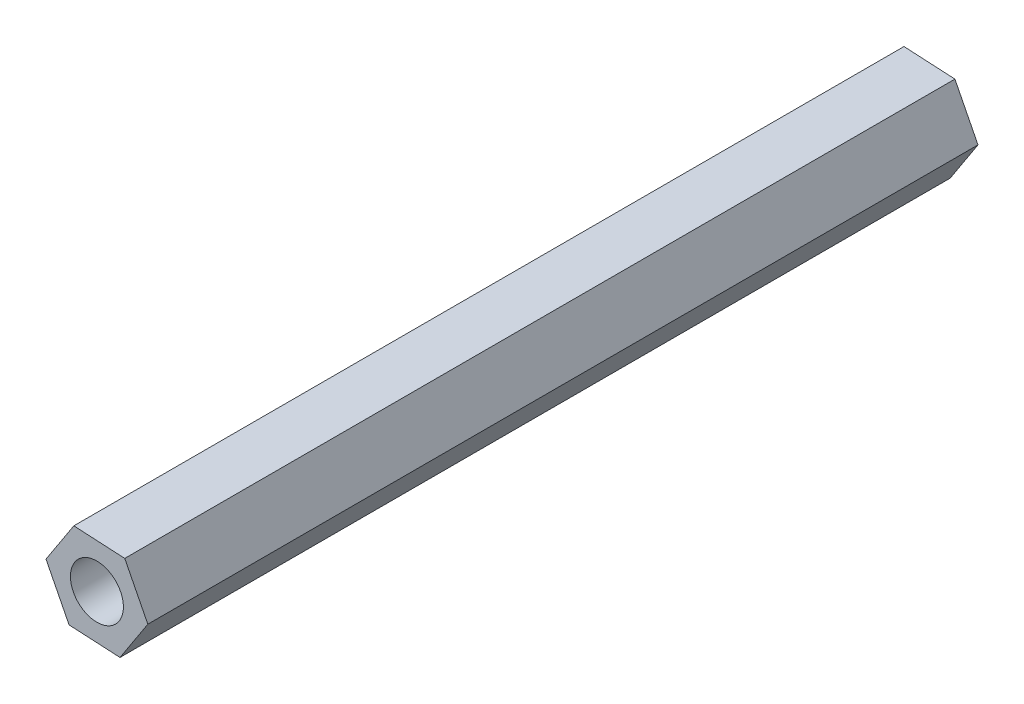
ISO-10303-21;
HEADER;
FILE_DESCRIPTION(('STEP AP214'),'2;1');
FILE_NAME('part.step','',(''),(''),'','','');
FILE_SCHEMA(('AUTOMOTIVE_DESIGN { 1 0 10303 214 1 1 1 1 }'));
ENDSEC;
DATA;
#1=APPLICATION_CONTEXT('core data for automotive mechanical design processes');
#2=APPLICATION_PROTOCOL_DEFINITION('international standard','automotive_design',2000,#1);
#3=PRODUCT_CONTEXT('',#1,'mechanical');
#4=PRODUCT('Part','Part','',(#3));
#5=PRODUCT_RELATED_PRODUCT_CATEGORY('part','',(#4));
#6=PRODUCT_DEFINITION_FORMATION('','',#4);
#7=PRODUCT_DEFINITION_CONTEXT('part definition',#1,'design');
#8=PRODUCT_DEFINITION('design','',#6,#7);
#9=PRODUCT_DEFINITION_SHAPE('','',#8);
#10=(LENGTH_UNIT() NAMED_UNIT(*) SI_UNIT(.MILLI.,.METRE.));
#11=(NAMED_UNIT(*) PLANE_ANGLE_UNIT() SI_UNIT($,.RADIAN.));
#12=(NAMED_UNIT(*) SI_UNIT($,.STERADIAN.) SOLID_ANGLE_UNIT());
#13=UNCERTAINTY_MEASURE_WITH_UNIT(LENGTH_MEASURE(1.E-05),#10,'distance_accuracy_value','');
#14=(GEOMETRIC_REPRESENTATION_CONTEXT(3) GLOBAL_UNCERTAINTY_ASSIGNED_CONTEXT((#13)) GLOBAL_UNIT_ASSIGNED_CONTEXT((#10,
#11,#12)) REPRESENTATION_CONTEXT('',''));
#15=CARTESIAN_POINT('',(0.,0.,0.));
#16=DIRECTION('',(0.,0.,1.));
#17=DIRECTION('',(1.,0.,0.));
#18=AXIS2_PLACEMENT_3D('',#15,#16,#17);
#19=CARTESIAN_POINT('',(2.8825916016709,-0.154916078280261,47.));
#20=DIRECTION('',(-0.891609732350342,-0.452804687672456,0.));
#21=DIRECTION('',(0.452804687672456,-0.891609732350343,0.));
#22=AXIS2_PLACEMENT_3D('',#19,#20,#21);
#23=PLANE('',#22);
#24=DIRECTION('',(-0.452804687672456,0.891609732350342,0.));
#25=VECTOR('',#24,1.);
#26=CARTESIAN_POINT('',(2.8825916016709,-0.154916078280261,0.));
#27=LINE('',#26,#25);
#28=CARTESIAN_POINT('',(2.8825916016709,-0.154916078280261,0.));
#29=VERTEX_POINT('',#28);
#30=CARTESIAN_POINT('',(1.57545706008081,2.41893951664254,0.));
#31=VERTEX_POINT('',#30);
#32=EDGE_CURVE('E115',#29,#31,#27,.T.);
#33=ORIENTED_EDGE('',*,*,#32,.T.);
#34=DIRECTION('',(0.,0.,-1.));
#35=VECTOR('',#34,1.);
#36=CARTESIAN_POINT('',(1.57545706008081,2.41893951664254,47.));
#37=LINE('',#36,#35);
#38=CARTESIAN_POINT('',(1.57545706008081,2.41893951664254,47.));
#39=VERTEX_POINT('',#38);
#40=EDGE_CURVE('E11',#39,#31,#37,.T.);
#41=ORIENTED_EDGE('',*,*,#40,.F.);
#42=DIRECTION('',(-0.452804687672456,0.891609732350342,0.));
#43=VECTOR('',#42,1.);
#44=CARTESIAN_POINT('',(2.8825916016709,-0.154916078280261,47.));
#45=LINE('',#44,#43);
#46=CARTESIAN_POINT('',(2.8825916016709,-0.154916078280261,47.));
#47=VERTEX_POINT('',#46);
#48=EDGE_CURVE('E126',#47,#39,#45,.T.);
#49=ORIENTED_EDGE('',*,*,#48,.F.);
#50=DIRECTION('',(0.,0.,-1.));
#51=VECTOR('',#50,1.);
#52=CARTESIAN_POINT('',(2.8825916016709,-0.154916078280261,47.));
#53=LINE('',#52,#51);
#54=EDGE_CURVE('E111',#47,#29,#53,.T.);
#55=ORIENTED_EDGE('',*,*,#54,.T.);
#56=EDGE_LOOP('',(#33,#41,#49,#55));
#57=FACE_BOUND('',#56,.T.);
#58=ADVANCED_FACE('F31',(#57),#23,.F.);
#59=CARTESIAN_POINT('',(1.57545706008081,2.41893951664254,47.));
#60=DIRECTION('',(-0.0536645036981452,-0.998559022313069,0.));
#61=DIRECTION('',(0.998559022313069,-0.0536645036981452,0.));
#62=AXIS2_PLACEMENT_3D('',#59,#60,#61);
#63=PLANE('',#62);
#64=DIRECTION('',(-0.998559022313069,0.0536645036981452,0.));
#65=VECTOR('',#64,1.);
#66=CARTESIAN_POINT('',(1.57545706008081,2.41893951664254,0.));
#67=LINE('',#66,#65);
#68=CARTESIAN_POINT('',(-1.30713454159008,2.5738555949228,0.));
#69=VERTEX_POINT('',#68);
#70=EDGE_CURVE('E118',#31,#69,#67,.T.);
#71=ORIENTED_EDGE('',*,*,#70,.T.);
#72=DIRECTION('',(0.,0.,-1.));
#73=VECTOR('',#72,1.);
#74=CARTESIAN_POINT('',(-1.30713454159008,2.5738555949228,47.));
#75=LINE('',#74,#73);
#76=CARTESIAN_POINT('',(-1.30713454159008,2.5738555949228,47.));
#77=VERTEX_POINT('',#76);
#78=EDGE_CURVE('E39',#77,#69,#75,.T.);
#79=ORIENTED_EDGE('',*,*,#78,.F.);
#80=DIRECTION('',(-0.998559022313069,0.0536645036981452,0.));
#81=VECTOR('',#80,1.);
#82=CARTESIAN_POINT('',(1.57545706008081,2.41893951664254,47.));
#83=LINE('',#82,#81);
#84=EDGE_CURVE('E84',#39,#77,#83,.T.);
#85=ORIENTED_EDGE('',*,*,#84,.F.);
#86=ORIENTED_EDGE('',*,*,#40,.T.);
#87=EDGE_LOOP('',(#71,#79,#85,#86));
#88=FACE_BOUND('',#87,.T.);
#89=ADVANCED_FACE('F151',(#88),#63,.F.);
#90=CARTESIAN_POINT('',(-1.30713454159008,2.5738555949228,47.));
#91=DIRECTION('',(0.837945228652197,-0.545754334640612,0.));
#92=DIRECTION('',(0.545754334640612,0.837945228652197,0.));
#93=AXIS2_PLACEMENT_3D('',#90,#91,#92);
#94=PLANE('',#93);
#95=DIRECTION('',(-0.545754334640612,-0.837945228652197,0.));
#96=VECTOR('',#95,1.);
#97=CARTESIAN_POINT('',(-1.30713454159008,2.5738555949228,0.));
#98=LINE('',#97,#96);
#99=CARTESIAN_POINT('',(-2.88259160167089,0.154916078280261,0.));
#100=VERTEX_POINT('',#99);
#101=EDGE_CURVE('E121',#69,#100,#98,.T.);
#102=ORIENTED_EDGE('',*,*,#101,.T.);
#103=DIRECTION('',(0.,0.,-1.));
#104=VECTOR('',#103,1.);
#105=CARTESIAN_POINT('',(-2.88259160167089,0.154916078280261,47.));
#106=LINE('',#105,#104);
#107=CARTESIAN_POINT('',(-2.88259160167089,0.154916078280261,47.));
#108=VERTEX_POINT('',#107);
#109=EDGE_CURVE('E106',#108,#100,#106,.T.);
#110=ORIENTED_EDGE('',*,*,#109,.F.);
#111=DIRECTION('',(-0.545754334640612,-0.837945228652197,0.));
#112=VECTOR('',#111,1.);
#113=CARTESIAN_POINT('',(-1.30713454159008,2.5738555949228,47.));
#114=LINE('',#113,#112);
#115=EDGE_CURVE('E97',#77,#108,#114,.T.);
#116=ORIENTED_EDGE('',*,*,#115,.F.);
#117=ORIENTED_EDGE('',*,*,#78,.T.);
#118=EDGE_LOOP('',(#102,#110,#116,#117));
#119=FACE_BOUND('',#118,.T.);
#120=ADVANCED_FACE('F132',(#119),#94,.F.);
#121=CARTESIAN_POINT('',(-2.88259160167089,0.154916078280261,47.));
#122=DIRECTION('',(0.891609732350342,0.452804687672456,0.));
#123=DIRECTION('',(-0.452804687672456,0.891609732350343,0.));
#124=AXIS2_PLACEMENT_3D('',#121,#122,#123);
#125=PLANE('',#124);
#126=DIRECTION('',(0.452804687672456,-0.891609732350343,0.));
#127=VECTOR('',#126,1.);
#128=CARTESIAN_POINT('',(-2.88259160167089,0.154916078280261,0.));
#129=LINE('',#128,#127);
#130=CARTESIAN_POINT('',(-1.57545706008081,-2.41893951664254,0.));
#131=VERTEX_POINT('',#130);
#132=EDGE_CURVE('E105',#100,#131,#129,.T.);
#133=ORIENTED_EDGE('',*,*,#132,.T.);
#134=DIRECTION('',(0.,0.,-1.));
#135=VECTOR('',#134,1.);
#136=CARTESIAN_POINT('',(-1.57545706008081,-2.41893951664254,47.));
#137=LINE('',#136,#135);
#138=CARTESIAN_POINT('',(-1.57545706008081,-2.41893951664254,47.));
#139=VERTEX_POINT('',#138);
#140=EDGE_CURVE('E102',#139,#131,#137,.T.);
#141=ORIENTED_EDGE('',*,*,#140,.F.);
#142=DIRECTION('',(0.452804687672456,-0.891609732350343,0.));
#143=VECTOR('',#142,1.);
#144=CARTESIAN_POINT('',(-2.88259160167089,0.154916078280261,47.));
#145=LINE('',#144,#143);
#146=EDGE_CURVE('E91',#108,#139,#145,.T.);
#147=ORIENTED_EDGE('',*,*,#146,.F.);
#148=ORIENTED_EDGE('',*,*,#109,.T.);
#149=EDGE_LOOP('',(#133,#141,#147,#148));
#150=FACE_BOUND('',#149,.T.);
#151=ADVANCED_FACE('F103',(#150),#125,.F.);
#152=CARTESIAN_POINT('',(-1.57545706008081,-2.41893951664254,47.));
#153=DIRECTION('',(0.0536645036981452,0.998559022313069,0.));
#154=DIRECTION('',(-0.998559022313069,0.0536645036981452,0.));
#155=AXIS2_PLACEMENT_3D('',#152,#153,#154);
#156=PLANE('',#155);
#157=DIRECTION('',(0.998559022313069,-0.0536645036981452,0.));
#158=VECTOR('',#157,1.);
#159=CARTESIAN_POINT('',(-1.57545706008081,-2.41893951664254,0.));
#160=LINE('',#159,#158);
#161=CARTESIAN_POINT('',(1.30713454159009,-2.5738555949228,0.));
#162=VERTEX_POINT('',#161);
#163=EDGE_CURVE('E70',#131,#162,#160,.T.);
#164=ORIENTED_EDGE('',*,*,#163,.T.);
#165=DIRECTION('',(0.,0.,-1.));
#166=VECTOR('',#165,1.);
#167=CARTESIAN_POINT('',(1.30713454159009,-2.5738555949228,47.));
#168=LINE('',#167,#166);
#169=CARTESIAN_POINT('',(1.30713454159009,-2.5738555949228,47.));
#170=VERTEX_POINT('',#169);
#171=EDGE_CURVE('E107',#170,#162,#168,.T.);
#172=ORIENTED_EDGE('',*,*,#171,.F.);
#173=DIRECTION('',(0.998559022313069,-0.0536645036981452,0.));
#174=VECTOR('',#173,1.);
#175=CARTESIAN_POINT('',(-1.57545706008081,-2.41893951664254,47.));
#176=LINE('',#175,#174);
#177=EDGE_CURVE('E95',#139,#170,#176,.T.);
#178=ORIENTED_EDGE('',*,*,#177,.F.);
#179=ORIENTED_EDGE('',*,*,#140,.T.);
#180=EDGE_LOOP('',(#164,#172,#178,#179));
#181=FACE_BOUND('',#180,.T.);
#182=ADVANCED_FACE('F109',(#181),#156,.F.);
#183=CARTESIAN_POINT('',(1.30713454159009,-2.5738555949228,47.));
#184=DIRECTION('',(-0.837945228652197,0.545754334640612,0.));
#185=DIRECTION('',(-0.545754334640612,-0.837945228652197,0.));
#186=AXIS2_PLACEMENT_3D('',#183,#184,#185);
#187=PLANE('',#186);
#188=DIRECTION('',(0.545754334640612,0.837945228652197,0.));
#189=VECTOR('',#188,1.);
#190=CARTESIAN_POINT('',(1.30713454159009,-2.5738555949228,0.));
#191=LINE('',#190,#189);
#192=EDGE_CURVE('E76',#162,#29,#191,.T.);
#193=ORIENTED_EDGE('',*,*,#192,.T.);
#194=ORIENTED_EDGE('',*,*,#54,.F.);
#195=DIRECTION('',(0.545754334640612,0.837945228652197,0.));
#196=VECTOR('',#195,1.);
#197=CARTESIAN_POINT('',(1.30713454159009,-2.5738555949228,47.));
#198=LINE('',#197,#196);
#199=EDGE_CURVE('E47',#170,#47,#198,.T.);
#200=ORIENTED_EDGE('',*,*,#199,.F.);
#201=ORIENTED_EDGE('',*,*,#171,.T.);
#202=EDGE_LOOP('',(#193,#194,#200,#201));
#203=FACE_BOUND('',#202,.T.);
#204=ADVANCED_FACE('F139',(#203),#187,.F.);
#205=CARTESIAN_POINT('',(1.57545706008081,2.41893951664254,47.));
#206=DIRECTION('',(0.,0.,1.));
#207=DIRECTION('',(1.,0.,0.));
#208=AXIS2_PLACEMENT_3D('',#205,#206,#207);
#209=PLANE('',#208);
#210=CARTESIAN_POINT('',(0.,0.,47.));
#211=DIRECTION('',(0.,0.,-1.));
#212=DIRECTION('',(-1.,0.,0.));
#213=AXIS2_PLACEMENT_3D('',#210,#211,#212);
#214=CIRCLE('',#213,1.5);
#215=CARTESIAN_POINT('',(-1.5,0.,47.));
#216=VERTEX_POINT('',#215);
#217=EDGE_CURVE('E119',#216,#216,#214,.T.);
#218=ORIENTED_EDGE('',*,*,#217,.T.);
#219=EDGE_LOOP('',(#218));
#220=FACE_BOUND('',#219,.T.);
#221=ORIENTED_EDGE('',*,*,#48,.T.);
#222=ORIENTED_EDGE('',*,*,#84,.T.);
#223=ORIENTED_EDGE('',*,*,#115,.T.);
#224=ORIENTED_EDGE('',*,*,#146,.T.);
#225=ORIENTED_EDGE('',*,*,#177,.T.);
#226=ORIENTED_EDGE('',*,*,#199,.T.);
#227=EDGE_LOOP('',(#221,#222,#223,#224,#225,#226));
#228=FACE_BOUND('',#227,.T.);
#229=ADVANCED_FACE('F93',(#220,#228),#209,.T.);
#230=CARTESIAN_POINT('',(1.57545706008081,2.41893951664254,0.));
#231=DIRECTION('',(0.,0.,1.));
#232=DIRECTION('',(1.,0.,0.));
#233=AXIS2_PLACEMENT_3D('',#230,#231,#232);
#234=PLANE('',#233);
#235=CARTESIAN_POINT('',(0.,0.,0.));
#236=DIRECTION('',(0.,0.,-1.));
#237=DIRECTION('',(-1.,0.,0.));
#238=AXIS2_PLACEMENT_3D('',#235,#236,#237);
#239=CIRCLE('',#238,1.5);
#240=CARTESIAN_POINT('',(-1.5,0.,0.));
#241=VERTEX_POINT('',#240);
#242=EDGE_CURVE('E206',#241,#241,#239,.T.);
#243=ORIENTED_EDGE('',*,*,#242,.F.);
#244=EDGE_LOOP('',(#243));
#245=FACE_BOUND('',#244,.T.);
#246=ORIENTED_EDGE('',*,*,#32,.F.);
#247=ORIENTED_EDGE('',*,*,#192,.F.);
#248=ORIENTED_EDGE('',*,*,#163,.F.);
#249=ORIENTED_EDGE('',*,*,#132,.F.);
#250=ORIENTED_EDGE('',*,*,#101,.F.);
#251=ORIENTED_EDGE('',*,*,#70,.F.);
#252=EDGE_LOOP('',(#246,#247,#248,#249,#250,#251));
#253=FACE_BOUND('',#252,.T.);
#254=ADVANCED_FACE('F135',(#245,#253),#234,.F.);
#255=CARTESIAN_POINT('',(0.,0.,47.));
#256=DIRECTION('',(0.,0.,-1.));
#257=DIRECTION('',(-1.,0.,0.));
#258=AXIS2_PLACEMENT_3D('',#255,#256,#257);
#259=CYLINDRICAL_SURFACE('',#258,1.5);
#260=ORIENTED_EDGE('',*,*,#217,.F.);
#261=EDGE_LOOP('',(#260));
#262=FACE_BOUND('',#261,.T.);
#263=ORIENTED_EDGE('',*,*,#242,.T.);
#264=EDGE_LOOP('',(#263));
#265=FACE_BOUND('',#264,.T.);
#266=ADVANCED_FACE('F188',(#262,#265),#259,.F.);
#267=CLOSED_SHELL('',(#58,#89,#120,#151,#182,#204,#229,#254,#266));
#268=MANIFOLD_SOLID_BREP('B2',#267);
#269=ADVANCED_BREP_SHAPE_REPRESENTATION('',(#18,#268),#14);
#270=SHAPE_DEFINITION_REPRESENTATION(#9,#269);
ENDSEC;
END-ISO-10303-21;
